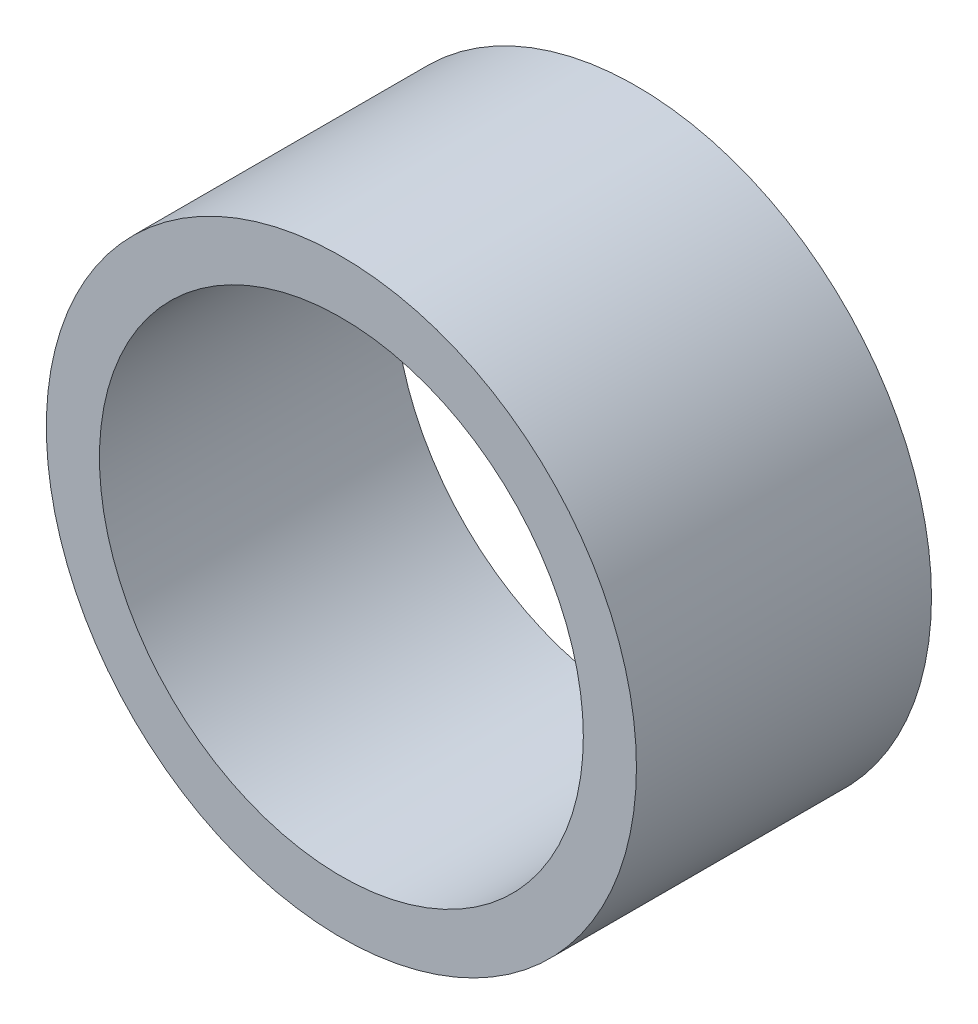
ISO-10303-21;
HEADER;
FILE_DESCRIPTION(('STEP AP214'),'2;1');
FILE_NAME('part.step','',(''),(''),'','','');
FILE_SCHEMA(('AUTOMOTIVE_DESIGN { 1 0 10303 214 1 1 1 1 }'));
ENDSEC;
DATA;
#1=APPLICATION_CONTEXT('core data for automotive mechanical design processes');
#2=APPLICATION_PROTOCOL_DEFINITION('international standard','automotive_design',2000,#1);
#3=PRODUCT_CONTEXT('',#1,'mechanical');
#4=PRODUCT('Part','Part','',(#3));
#5=PRODUCT_RELATED_PRODUCT_CATEGORY('part','',(#4));
#6=PRODUCT_DEFINITION_FORMATION('','',#4);
#7=PRODUCT_DEFINITION_CONTEXT('part definition',#1,'design');
#8=PRODUCT_DEFINITION('design','',#6,#7);
#9=PRODUCT_DEFINITION_SHAPE('','',#8);
#10=(LENGTH_UNIT() NAMED_UNIT(*) SI_UNIT(.MILLI.,.METRE.));
#11=(NAMED_UNIT(*) PLANE_ANGLE_UNIT() SI_UNIT($,.RADIAN.));
#12=(NAMED_UNIT(*) SI_UNIT($,.STERADIAN.) SOLID_ANGLE_UNIT());
#13=UNCERTAINTY_MEASURE_WITH_UNIT(LENGTH_MEASURE(1.E-05),#10,'distance_accuracy_value','');
#14=(GEOMETRIC_REPRESENTATION_CONTEXT(3) GLOBAL_UNCERTAINTY_ASSIGNED_CONTEXT((#13)) GLOBAL_UNIT_ASSIGNED_CONTEXT((#10,
#11,#12)) REPRESENTATION_CONTEXT('',''));
#15=CARTESIAN_POINT('',(0.,0.,0.));
#16=DIRECTION('',(0.,0.,1.));
#17=DIRECTION('',(1.,0.,0.));
#18=AXIS2_PLACEMENT_3D('',#15,#16,#17);
#19=CARTESIAN_POINT('',(0.,0.,5.));
#20=DIRECTION('',(0.,0.,1.));
#21=DIRECTION('',(1.,0.,0.));
#22=AXIS2_PLACEMENT_3D('',#19,#20,#21);
#23=CYLINDRICAL_SURFACE('',#22,4.1);
#24=CARTESIAN_POINT('',(0.,0.,5.));
#25=DIRECTION('',(0.,0.,1.));
#26=DIRECTION('',(1.,0.,0.));
#27=AXIS2_PLACEMENT_3D('',#24,#25,#26);
#28=CIRCLE('',#27,4.1);
#29=CARTESIAN_POINT('',(4.1,0.,5.));
#30=VERTEX_POINT('',#29);
#31=EDGE_CURVE('E27',#30,#30,#28,.F.);
#32=ORIENTED_EDGE('',*,*,#31,.F.);
#33=EDGE_LOOP('',(#32));
#34=FACE_BOUND('',#33,.T.);
#35=CARTESIAN_POINT('',(0.,0.,0.));
#36=DIRECTION('',(0.,0.,1.));
#37=DIRECTION('',(1.,0.,0.));
#38=AXIS2_PLACEMENT_3D('',#35,#36,#37);
#39=CIRCLE('',#38,4.1);
#40=CARTESIAN_POINT('',(4.1,0.,0.));
#41=VERTEX_POINT('',#40);
#42=EDGE_CURVE('E18',#41,#41,#39,.F.);
#43=ORIENTED_EDGE('',*,*,#42,.T.);
#44=EDGE_LOOP('',(#43));
#45=FACE_BOUND('',#44,.T.);
#46=ADVANCED_FACE('F15',(#34,#45),#23,.F.);
#47=CARTESIAN_POINT('',(0.,0.,0.));
#48=DIRECTION('',(0.,0.,1.));
#49=DIRECTION('',(1.,0.,0.));
#50=AXIS2_PLACEMENT_3D('',#47,#48,#49);
#51=PLANE('',#50);
#52=ORIENTED_EDGE('',*,*,#42,.F.);
#53=EDGE_LOOP('',(#52));
#54=FACE_BOUND('',#53,.T.);
#55=CARTESIAN_POINT('',(0.,0.,0.));
#56=DIRECTION('',(0.,0.,1.));
#57=DIRECTION('',(1.,0.,0.));
#58=AXIS2_PLACEMENT_3D('',#55,#56,#57);
#59=CIRCLE('',#58,5.);
#60=CARTESIAN_POINT('',(5.,0.,0.));
#61=VERTEX_POINT('',#60);
#62=EDGE_CURVE('E22',#61,#61,#59,.T.);
#63=ORIENTED_EDGE('',*,*,#62,.F.);
#64=EDGE_LOOP('',(#63));
#65=FACE_BOUND('',#64,.T.);
#66=ADVANCED_FACE('F36',(#54,#65),#51,.F.);
#67=CARTESIAN_POINT('',(0.,0.,5.));
#68=DIRECTION('',(0.,0.,1.));
#69=DIRECTION('',(1.,0.,0.));
#70=AXIS2_PLACEMENT_3D('',#67,#68,#69);
#71=PLANE('',#70);
#72=ORIENTED_EDGE('',*,*,#31,.T.);
#73=EDGE_LOOP('',(#72));
#74=FACE_BOUND('',#73,.T.);
#75=CARTESIAN_POINT('',(0.,0.,5.));
#76=DIRECTION('',(0.,0.,1.));
#77=DIRECTION('',(1.,0.,0.));
#78=AXIS2_PLACEMENT_3D('',#75,#76,#77);
#79=CIRCLE('',#78,5.);
#80=CARTESIAN_POINT('',(5.,0.,5.));
#81=VERTEX_POINT('',#80);
#82=EDGE_CURVE('E9',#81,#81,#79,.F.);
#83=ORIENTED_EDGE('',*,*,#82,.F.);
#84=EDGE_LOOP('',(#83));
#85=FACE_BOUND('',#84,.T.);
#86=ADVANCED_FACE('F39',(#74,#85),#71,.T.);
#87=CARTESIAN_POINT('',(0.,0.,5.));
#88=DIRECTION('',(0.,0.,1.));
#89=DIRECTION('',(1.,0.,0.));
#90=AXIS2_PLACEMENT_3D('',#87,#88,#89);
#91=CYLINDRICAL_SURFACE('',#90,5.);
#92=ORIENTED_EDGE('',*,*,#62,.T.);
#93=EDGE_LOOP('',(#92));
#94=FACE_BOUND('',#93,.T.);
#95=ORIENTED_EDGE('',*,*,#82,.T.);
#96=EDGE_LOOP('',(#95));
#97=FACE_BOUND('',#96,.T.);
#98=ADVANCED_FACE('F42',(#94,#97),#91,.T.);
#99=CLOSED_SHELL('',(#46,#66,#86,#98));
#100=MANIFOLD_SOLID_BREP('B1',#99);
#101=ADVANCED_BREP_SHAPE_REPRESENTATION('',(#18,#100),#14);
#102=SHAPE_DEFINITION_REPRESENTATION(#9,#101);
ENDSEC;
END-ISO-10303-21;
